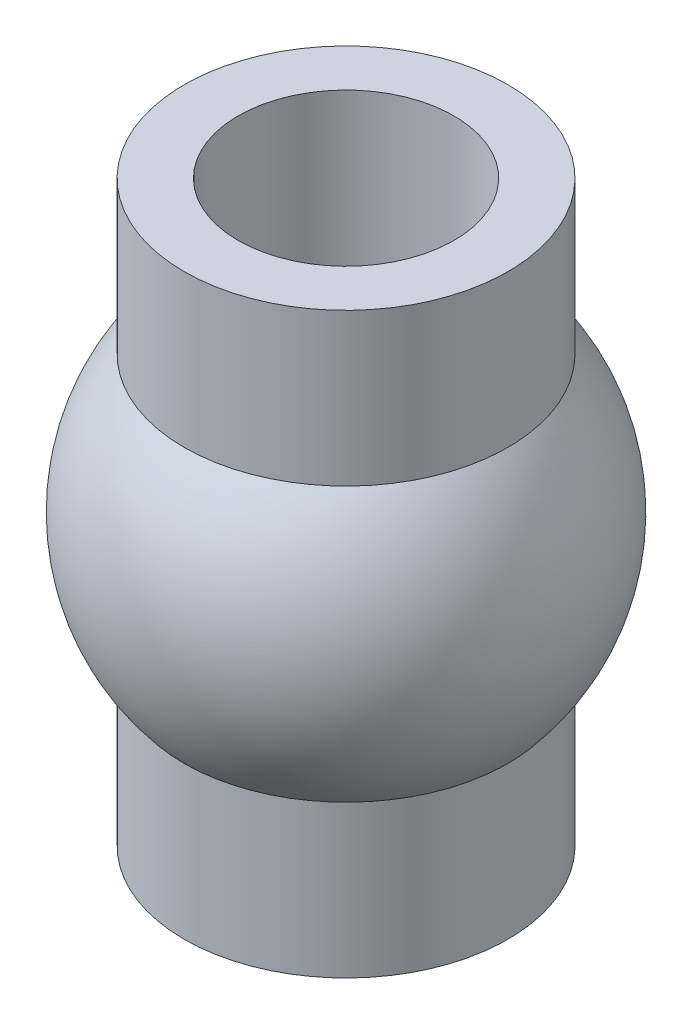
ISO-10303-21;
HEADER;
FILE_DESCRIPTION(('STEP AP214'),'2;1');
FILE_NAME('part.step','',(''),(''),'','','');
FILE_SCHEMA(('AUTOMOTIVE_DESIGN { 1 0 10303 214 1 1 1 1 }'));
ENDSEC;
DATA;
#1=APPLICATION_CONTEXT('core data for automotive mechanical design processes');
#2=APPLICATION_PROTOCOL_DEFINITION('international standard','automotive_design',2000,#1);
#3=PRODUCT_CONTEXT('',#1,'mechanical');
#4=PRODUCT('Part','Part','',(#3));
#5=PRODUCT_RELATED_PRODUCT_CATEGORY('part','',(#4));
#6=PRODUCT_DEFINITION_FORMATION('','',#4);
#7=PRODUCT_DEFINITION_CONTEXT('part definition',#1,'design');
#8=PRODUCT_DEFINITION('design','',#6,#7);
#9=PRODUCT_DEFINITION_SHAPE('','',#8);
#10=(LENGTH_UNIT() NAMED_UNIT(*) SI_UNIT(.MILLI.,.METRE.));
#11=(NAMED_UNIT(*) PLANE_ANGLE_UNIT() SI_UNIT($,.RADIAN.));
#12=(NAMED_UNIT(*) SI_UNIT($,.STERADIAN.) SOLID_ANGLE_UNIT());
#13=UNCERTAINTY_MEASURE_WITH_UNIT(LENGTH_MEASURE(1.E-05),#10,'distance_accuracy_value','');
#14=(GEOMETRIC_REPRESENTATION_CONTEXT(3) GLOBAL_UNCERTAINTY_ASSIGNED_CONTEXT((#13)) GLOBAL_UNIT_ASSIGNED_CONTEXT((#10,
#11,#12)) REPRESENTATION_CONTEXT('',''));
#15=CARTESIAN_POINT('',(0.,0.,0.));
#16=DIRECTION('',(0.,0.,1.));
#17=DIRECTION('',(1.,0.,0.));
#18=AXIS2_PLACEMENT_3D('',#15,#16,#17);
#19=CARTESIAN_POINT('',(-2.1,0.,0.));
#20=DIRECTION('',(0.,1.,0.));
#21=DIRECTION('',(0.,0.,1.));
#22=AXIS2_PLACEMENT_3D('',#19,#20,#21);
#23=PLANE('',#22);
#24=CARTESIAN_POINT('',(0.,0.,0.));
#25=DIRECTION('',(0.,1.,0.));
#26=DIRECTION('',(0.,0.,1.));
#27=AXIS2_PLACEMENT_3D('',#24,#25,#26);
#28=CIRCLE('',#27,1.4);
#29=CARTESIAN_POINT('',(0.,0.,1.4));
#30=VERTEX_POINT('',#29);
#31=EDGE_CURVE('E66',#30,#30,#28,.F.);
#32=ORIENTED_EDGE('',*,*,#31,.F.);
#33=EDGE_LOOP('',(#32));
#34=FACE_BOUND('',#33,.T.);
#35=CARTESIAN_POINT('',(0.,0.,0.));
#36=DIRECTION('',(0.,-1.,0.));
#37=DIRECTION('',(0.,0.,-1.));
#38=AXIS2_PLACEMENT_3D('',#35,#36,#37);
#39=CIRCLE('',#38,2.1);
#40=CARTESIAN_POINT('',(0.,0.,-2.1));
#41=VERTEX_POINT('',#40);
#42=EDGE_CURVE('E60',#41,#41,#39,.T.);
#43=ORIENTED_EDGE('',*,*,#42,.T.);
#44=EDGE_LOOP('',(#43));
#45=FACE_BOUND('',#44,.T.);
#46=ADVANCED_FACE('F43',(#34,#45),#23,.F.);
#47=CARTESIAN_POINT('',(0.,7.5,0.));
#48=DIRECTION('',(0.,-1.,0.));
#49=DIRECTION('',(0.,0.,-1.));
#50=AXIS2_PLACEMENT_3D('',#47,#48,#49);
#51=PLANE('',#50);
#52=CARTESIAN_POINT('',(0.,7.5,0.));
#53=DIRECTION('',(0.,1.,0.));
#54=DIRECTION('',(0.,0.,1.));
#55=AXIS2_PLACEMENT_3D('',#52,#53,#54);
#56=CIRCLE('',#55,1.4);
#57=CARTESIAN_POINT('',(0.,7.5,1.4));
#58=VERTEX_POINT('',#57);
#59=EDGE_CURVE('E70',#58,#58,#56,.T.);
#60=ORIENTED_EDGE('',*,*,#59,.F.);
#61=EDGE_LOOP('',(#60));
#62=FACE_BOUND('',#61,.T.);
#63=CARTESIAN_POINT('',(0.,7.5,0.));
#64=DIRECTION('',(0.,-1.,0.));
#65=DIRECTION('',(0.,0.,-1.));
#66=AXIS2_PLACEMENT_3D('',#63,#64,#65);
#67=CIRCLE('',#66,2.1);
#68=CARTESIAN_POINT('',(0.,7.5,-2.1));
#69=VERTEX_POINT('',#68);
#70=EDGE_CURVE('E10',#69,#69,#67,.T.);
#71=ORIENTED_EDGE('',*,*,#70,.F.);
#72=EDGE_LOOP('',(#71));
#73=FACE_BOUND('',#72,.T.);
#74=ADVANCED_FACE('F77',(#62,#73),#51,.F.);
#75=CARTESIAN_POINT('',(0.,0.,0.));
#76=DIRECTION('',(0.,-1.,0.));
#77=DIRECTION('',(0.,0.,-1.));
#78=AXIS2_PLACEMENT_3D('',#75,#76,#77);
#79=CYLINDRICAL_SURFACE('',#78,2.1);
#80=CARTESIAN_POINT('',(0.,5.52552809045647,0.));
#81=DIRECTION('',(0.,-1.,0.));
#82=DIRECTION('',(0.,0.,-1.));
#83=AXIS2_PLACEMENT_3D('',#80,#81,#82);
#84=CIRCLE('',#83,2.1);
#85=CARTESIAN_POINT('',(0.,5.52552809045647,-2.1));
#86=VERTEX_POINT('',#85);
#87=EDGE_CURVE('E50',#86,#86,#84,.T.);
#88=ORIENTED_EDGE('',*,*,#87,.F.);
#89=EDGE_LOOP('',(#88));
#90=FACE_BOUND('',#89,.T.);
#91=ORIENTED_EDGE('',*,*,#70,.T.);
#92=EDGE_LOOP('',(#91));
#93=FACE_BOUND('',#92,.T.);
#94=ADVANCED_FACE('F80',(#90,#93),#79,.T.);
#95=CARTESIAN_POINT('',(0.,3.75,0.));
#96=DIRECTION('',(0.,-1.,0.));
#97=DIRECTION('',(-1.,0.,0.));
#98=AXIS2_PLACEMENT_3D('',#95,#96,#97);
#99=SPHERICAL_SURFACE('',#98,2.75);
#100=CARTESIAN_POINT('',(0.,1.97447190954353,0.));
#101=DIRECTION('',(0.,-1.,0.));
#102=DIRECTION('',(0.,0.,-1.));
#103=AXIS2_PLACEMENT_3D('',#100,#101,#102);
#104=CIRCLE('',#103,2.1);
#105=CARTESIAN_POINT('',(0.,1.97447190954353,-2.1));
#106=VERTEX_POINT('',#105);
#107=EDGE_CURVE('E55',#106,#106,#104,.T.);
#108=ORIENTED_EDGE('',*,*,#107,.F.);
#109=EDGE_LOOP('',(#108));
#110=FACE_BOUND('',#109,.T.);
#111=ORIENTED_EDGE('',*,*,#87,.T.);
#112=EDGE_LOOP('',(#111));
#113=FACE_BOUND('',#112,.T.);
#114=ADVANCED_FACE('F86',(#110,#113),#99,.T.);
#115=CARTESIAN_POINT('',(0.,0.,0.));
#116=DIRECTION('',(0.,-1.,0.));
#117=DIRECTION('',(0.,0.,-1.));
#118=AXIS2_PLACEMENT_3D('',#115,#116,#117);
#119=CYLINDRICAL_SURFACE('',#118,2.1);
#120=ORIENTED_EDGE('',*,*,#42,.F.);
#121=EDGE_LOOP('',(#120));
#122=FACE_BOUND('',#121,.T.);
#123=ORIENTED_EDGE('',*,*,#107,.T.);
#124=EDGE_LOOP('',(#123));
#125=FACE_BOUND('',#124,.T.);
#126=ADVANCED_FACE('F93',(#122,#125),#119,.T.);
#127=CARTESIAN_POINT('',(0.,-3.95979797464466,0.));
#128=DIRECTION('',(0.,1.,0.));
#129=DIRECTION('',(0.,0.,1.));
#130=AXIS2_PLACEMENT_3D('',#127,#128,#129);
#131=CYLINDRICAL_SURFACE('',#130,1.4);
#132=ORIENTED_EDGE('',*,*,#31,.T.);
#133=EDGE_LOOP('',(#132));
#134=FACE_BOUND('',#133,.T.);
#135=ORIENTED_EDGE('',*,*,#59,.T.);
#136=EDGE_LOOP('',(#135));
#137=FACE_BOUND('',#136,.T.);
#138=ADVANCED_FACE('F75',(#134,#137),#131,.F.);
#139=CLOSED_SHELL('',(#46,#74,#94,#114,#126,#138));
#140=MANIFOLD_SOLID_BREP('B2',#139);
#141=ADVANCED_BREP_SHAPE_REPRESENTATION('',(#18,#140),#14);
#142=SHAPE_DEFINITION_REPRESENTATION(#9,#141);
ENDSEC;
END-ISO-10303-21;
